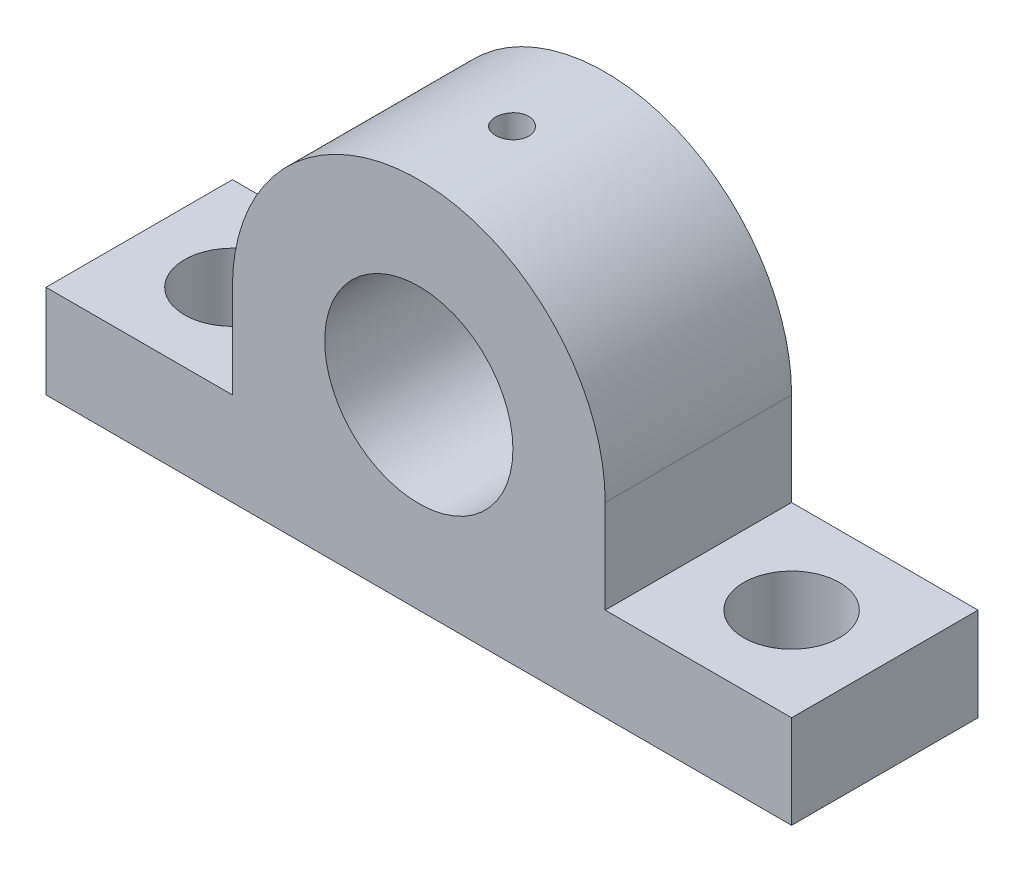
ISO-10303-21;
HEADER;
FILE_DESCRIPTION(('STEP AP214'),'2;1');
FILE_NAME('part.step','',(''),(''),'','','');
FILE_SCHEMA(('AUTOMOTIVE_DESIGN { 1 0 10303 214 1 1 1 1 }'));
ENDSEC;
DATA;
#1=APPLICATION_CONTEXT('core data for automotive mechanical design processes');
#2=APPLICATION_PROTOCOL_DEFINITION('international standard','automotive_design',2000,#1);
#3=PRODUCT_CONTEXT('',#1,'mechanical');
#4=PRODUCT('Part','Part','',(#3));
#5=PRODUCT_RELATED_PRODUCT_CATEGORY('part','',(#4));
#6=PRODUCT_DEFINITION_FORMATION('','',#4);
#7=PRODUCT_DEFINITION_CONTEXT('part definition',#1,'design');
#8=PRODUCT_DEFINITION('design','',#6,#7);
#9=PRODUCT_DEFINITION_SHAPE('','',#8);
#10=(LENGTH_UNIT() NAMED_UNIT(*) SI_UNIT(.MILLI.,.METRE.));
#11=(NAMED_UNIT(*) PLANE_ANGLE_UNIT() SI_UNIT($,.RADIAN.));
#12=(NAMED_UNIT(*) SI_UNIT($,.STERADIAN.) SOLID_ANGLE_UNIT());
#13=UNCERTAINTY_MEASURE_WITH_UNIT(LENGTH_MEASURE(1.E-05),#10,'distance_accuracy_value','');
#14=(GEOMETRIC_REPRESENTATION_CONTEXT(3) GLOBAL_UNCERTAINTY_ASSIGNED_CONTEXT((#13)) GLOBAL_UNIT_ASSIGNED_CONTEXT((#10,
#11,#12)) REPRESENTATION_CONTEXT('',''));
#15=CARTESIAN_POINT('',(0.,0.,0.));
#16=DIRECTION('',(0.,0.,1.));
#17=DIRECTION('',(1.,0.,0.));
#18=AXIS2_PLACEMENT_3D('',#15,#16,#17);
#19=CARTESIAN_POINT('',(0.,12.7,12.7));
#20=DIRECTION('',(0.,0.,-1.));
#21=DIRECTION('',(-1.,0.,0.));
#22=AXIS2_PLACEMENT_3D('',#19,#20,#21);
#23=PLANE('',#22);
#24=CARTESIAN_POINT('',(0.,12.7,12.7));
#25=DIRECTION('',(0.,0.,1.));
#26=DIRECTION('',(-1.,0.,0.));
#27=AXIS2_PLACEMENT_3D('',#24,#25,#26);
#28=CIRCLE('',#27,12.7);
#29=CARTESIAN_POINT('',(12.7,12.7,12.7));
#30=VERTEX_POINT('',#29);
#31=CARTESIAN_POINT('',(-12.7,12.7,12.7));
#32=VERTEX_POINT('',#31);
#33=EDGE_CURVE('E154',#30,#32,#28,.T.);
#34=ORIENTED_EDGE('',*,*,#33,.T.);
#35=DIRECTION('',(0.,-1.,0.));
#36=VECTOR('',#35,1.);
#37=CARTESIAN_POINT('',(-12.7,6.34999999999998,12.7));
#38=LINE('',#37,#36);
#39=CARTESIAN_POINT('',(-12.7,6.34999999999998,12.7));
#40=VERTEX_POINT('',#39);
#41=EDGE_CURVE('E102',#32,#40,#38,.T.);
#42=ORIENTED_EDGE('',*,*,#41,.T.);
#43=DIRECTION('',(-1.,0.,0.));
#44=VECTOR('',#43,1.);
#45=CARTESIAN_POINT('',(-25.4,6.35,12.7));
#46=LINE('',#45,#44);
#47=CARTESIAN_POINT('',(-25.4,6.35,12.7));
#48=VERTEX_POINT('',#47);
#49=EDGE_CURVE('E186',#40,#48,#46,.T.);
#50=ORIENTED_EDGE('',*,*,#49,.T.);
#51=DIRECTION('',(0.,-1.,0.));
#52=VECTOR('',#51,1.);
#53=CARTESIAN_POINT('',(-25.4,0.,12.7));
#54=LINE('',#53,#52);
#55=CARTESIAN_POINT('',(-25.4,0.,12.7));
#56=VERTEX_POINT('',#55);
#57=EDGE_CURVE('E185',#48,#56,#54,.T.);
#58=ORIENTED_EDGE('',*,*,#57,.T.);
#59=DIRECTION('',(1.,0.,0.));
#60=VECTOR('',#59,1.);
#61=CARTESIAN_POINT('',(25.4,0.,12.7));
#62=LINE('',#61,#60);
#63=CARTESIAN_POINT('',(25.4,0.,12.7));
#64=VERTEX_POINT('',#63);
#65=EDGE_CURVE('E121',#56,#64,#62,.T.);
#66=ORIENTED_EDGE('',*,*,#65,.T.);
#67=DIRECTION('',(0.,1.,0.));
#68=VECTOR('',#67,1.);
#69=CARTESIAN_POINT('',(25.4,6.35,12.7));
#70=LINE('',#69,#68);
#71=CARTESIAN_POINT('',(25.4,6.35,12.7));
#72=VERTEX_POINT('',#71);
#73=EDGE_CURVE('E115',#64,#72,#70,.T.);
#74=ORIENTED_EDGE('',*,*,#73,.T.);
#75=DIRECTION('',(-1.,0.,0.));
#76=VECTOR('',#75,1.);
#77=CARTESIAN_POINT('',(12.7,6.34999999999998,12.7));
#78=LINE('',#77,#76);
#79=CARTESIAN_POINT('',(12.7,6.34999999999998,12.7));
#80=VERTEX_POINT('',#79);
#81=EDGE_CURVE('E119',#72,#80,#78,.T.);
#82=ORIENTED_EDGE('',*,*,#81,.T.);
#83=DIRECTION('',(0.,1.,0.));
#84=VECTOR('',#83,1.);
#85=CARTESIAN_POINT('',(12.7,12.7,12.7));
#86=LINE('',#85,#84);
#87=EDGE_CURVE('E58',#80,#30,#86,.T.);
#88=ORIENTED_EDGE('',*,*,#87,.T.);
#89=EDGE_LOOP('',(#34,#42,#50,#58,#66,#74,#82,#88));
#90=FACE_BOUND('',#89,.T.);
#91=CARTESIAN_POINT('',(0.,12.7,12.7));
#92=DIRECTION('',(0.,0.,1.));
#93=DIRECTION('',(1.,0.,0.));
#94=AXIS2_PLACEMENT_3D('',#91,#92,#93);
#95=CIRCLE('',#94,6.4135);
#96=CARTESIAN_POINT('',(6.4135,12.7,12.7));
#97=VERTEX_POINT('',#96);
#98=EDGE_CURVE('E143',#97,#97,#95,.T.);
#99=ORIENTED_EDGE('',*,*,#98,.F.);
#100=EDGE_LOOP('',(#99));
#101=FACE_BOUND('',#100,.T.);
#102=ADVANCED_FACE('F37',(#90,#101),#23,.F.);
#103=CARTESIAN_POINT('',(0.,12.7,0.));
#104=DIRECTION('',(0.,0.,-1.));
#105=DIRECTION('',(-1.,0.,0.));
#106=AXIS2_PLACEMENT_3D('',#103,#104,#105);
#107=PLANE('',#106);
#108=CARTESIAN_POINT('',(0.,12.7,0.));
#109=DIRECTION('',(0.,0.,1.));
#110=DIRECTION('',(-1.,0.,0.));
#111=AXIS2_PLACEMENT_3D('',#108,#109,#110);
#112=CIRCLE('',#111,12.7);
#113=CARTESIAN_POINT('',(12.7,12.7,0.));
#114=VERTEX_POINT('',#113);
#115=CARTESIAN_POINT('',(-12.7,12.7,0.));
#116=VERTEX_POINT('',#115);
#117=EDGE_CURVE('E139',#114,#116,#112,.T.);
#118=ORIENTED_EDGE('',*,*,#117,.F.);
#119=DIRECTION('',(0.,1.,0.));
#120=VECTOR('',#119,1.);
#121=CARTESIAN_POINT('',(12.7,12.7,0.));
#122=LINE('',#121,#120);
#123=CARTESIAN_POINT('',(12.7,6.34999999999998,0.));
#124=VERTEX_POINT('',#123);
#125=EDGE_CURVE('E93',#124,#114,#122,.T.);
#126=ORIENTED_EDGE('',*,*,#125,.F.);
#127=DIRECTION('',(-1.,0.,0.));
#128=VECTOR('',#127,1.);
#129=CARTESIAN_POINT('',(12.7,6.34999999999998,0.));
#130=LINE('',#129,#128);
#131=CARTESIAN_POINT('',(25.4,6.35,0.));
#132=VERTEX_POINT('',#131);
#133=EDGE_CURVE('E87',#132,#124,#130,.T.);
#134=ORIENTED_EDGE('',*,*,#133,.F.);
#135=DIRECTION('',(0.,1.,0.));
#136=VECTOR('',#135,1.);
#137=CARTESIAN_POINT('',(25.4,6.35,0.));
#138=LINE('',#137,#136);
#139=CARTESIAN_POINT('',(25.4,0.,0.));
#140=VERTEX_POINT('',#139);
#141=EDGE_CURVE('E129',#140,#132,#138,.T.);
#142=ORIENTED_EDGE('',*,*,#141,.F.);
#143=DIRECTION('',(1.,0.,0.));
#144=VECTOR('',#143,1.);
#145=CARTESIAN_POINT('',(25.4,0.,0.));
#146=LINE('',#145,#144);
#147=CARTESIAN_POINT('',(-25.4,0.,0.));
#148=VERTEX_POINT('',#147);
#149=EDGE_CURVE('E149',#148,#140,#146,.T.);
#150=ORIENTED_EDGE('',*,*,#149,.F.);
#151=DIRECTION('',(0.,-1.,0.));
#152=VECTOR('',#151,1.);
#153=CARTESIAN_POINT('',(-25.4,0.,0.));
#154=LINE('',#153,#152);
#155=CARTESIAN_POINT('',(-25.4,6.35,0.));
#156=VERTEX_POINT('',#155);
#157=EDGE_CURVE('E147',#156,#148,#154,.T.);
#158=ORIENTED_EDGE('',*,*,#157,.F.);
#159=DIRECTION('',(-1.,0.,0.));
#160=VECTOR('',#159,1.);
#161=CARTESIAN_POINT('',(-25.4,6.35,0.));
#162=LINE('',#161,#160);
#163=CARTESIAN_POINT('',(-12.7,6.34999999999998,0.));
#164=VERTEX_POINT('',#163);
#165=EDGE_CURVE('E145',#164,#156,#162,.T.);
#166=ORIENTED_EDGE('',*,*,#165,.F.);
#167=DIRECTION('',(0.,-1.,0.));
#168=VECTOR('',#167,1.);
#169=CARTESIAN_POINT('',(-12.7,6.34999999999998,0.));
#170=LINE('',#169,#168);
#171=EDGE_CURVE('E142',#116,#164,#170,.T.);
#172=ORIENTED_EDGE('',*,*,#171,.F.);
#173=EDGE_LOOP('',(#118,#126,#134,#142,#150,#158,#166,#172));
#174=FACE_BOUND('',#173,.T.);
#175=CARTESIAN_POINT('',(0.,12.7,0.));
#176=DIRECTION('',(0.,0.,1.));
#177=DIRECTION('',(1.,0.,0.));
#178=AXIS2_PLACEMENT_3D('',#175,#176,#177);
#179=CIRCLE('',#178,6.4135);
#180=CARTESIAN_POINT('',(6.4135,12.7,0.));
#181=VERTEX_POINT('',#180);
#182=EDGE_CURVE('E192',#181,#181,#179,.T.);
#183=ORIENTED_EDGE('',*,*,#182,.T.);
#184=EDGE_LOOP('',(#183));
#185=FACE_BOUND('',#184,.T.);
#186=ADVANCED_FACE('F172',(#174,#185),#107,.T.);
#187=CARTESIAN_POINT('',(0.,12.7,12.7));
#188=DIRECTION('',(0.,0.,-1.));
#189=DIRECTION('',(-1.,0.,0.));
#190=AXIS2_PLACEMENT_3D('',#187,#188,#189);
#191=CYLINDRICAL_SURFACE('',#190,12.7);
#192=CARTESIAN_POINT('',(0.,25.4,7.48029999999999));
#193=CARTESIAN_POINT('',(-0.0633549662870578,25.3999993442662,7.48029724003476));
#194=CARTESIAN_POINT('',(-0.126752665207346,25.3995208743728,7.47495536954308));
#195=CARTESIAN_POINT('',(-0.251792843437397,25.3976581682521,7.45372488396833));
#196=CARTESIAN_POINT('',(-0.313433270551565,25.3962729149133,7.4378244253475));
#197=CARTESIAN_POINT('',(-0.433129919396753,25.3927531279238,7.39594120531932));
#198=CARTESIAN_POINT('',(-0.491188190521168,25.3906190274599,7.36996427195248));
#199=CARTESIAN_POINT('',(-0.602106922425868,25.38584065064,7.30867620975679));
#200=CARTESIAN_POINT('',(-0.654968466792388,25.3831964809822,7.27336703251195));
#201=CARTESIAN_POINT('',(-0.754159197131338,25.3776859812866,7.1943070358195));
#202=CARTESIAN_POINT('',(-0.800471309893536,25.3748190997261,7.15053483238661));
#203=CARTESIAN_POINT('',(-0.885101966605941,25.3691908973995,7.0558366654742));
#204=CARTESIAN_POINT('',(-0.923420153597663,25.3664295813516,7.00491038270831));
#205=CARTESIAN_POINT('',(-0.991034006795324,25.3613193372878,6.89724503088178));
#206=CARTESIAN_POINT('',(-1.02031450821889,25.3589711052143,6.8404964024736));
#207=CARTESIAN_POINT('',(-1.06892497046168,25.3549594154603,6.7228637545467));
#208=CARTESIAN_POINT('',(-1.0882551293388,25.35329594415,6.66197981736708));
#209=CARTESIAN_POINT('',(-1.11636627626064,25.3508468875705,6.53797702762159));
#210=CARTESIAN_POINT('',(-1.12517526603385,25.35005897243,6.4748645697588));
#211=CARTESIAN_POINT('',(-1.13208054267278,25.3494429242787,6.34805236994686));
#212=CARTESIAN_POINT('',(-1.13017705628481,25.3496147709531,6.28435264045674));
#213=CARTESIAN_POINT('',(-1.11573453505945,25.3508967086965,6.15836635356778));
#214=CARTESIAN_POINT('',(-1.10322597749987,25.3520041110958,6.09607627119771));
#215=CARTESIAN_POINT('',(-1.06797575874834,25.3550281729631,5.97448319903358));
#216=CARTESIAN_POINT('',(-1.04523398531445,25.3569448413074,5.91518024201141));
#217=CARTESIAN_POINT('',(-0.990128920983864,25.361374570342,5.8011479590833));
#218=CARTESIAN_POINT('',(-0.957752004966509,25.3638884745654,5.74642525149116));
#219=CARTESIAN_POINT('',(-0.884305528900142,25.3692286657572,5.643179234958));
#220=CARTESIAN_POINT('',(-0.843235767712833,25.3720549599532,5.59465606950595));
#221=CARTESIAN_POINT('',(-0.753398711268003,25.3777134478915,5.50500935657507));
#222=CARTESIAN_POINT('',(-0.704605076649212,25.3805456278451,5.46391219888644));
#223=CARTESIAN_POINT('',(-0.600797098391808,25.3858874119665,5.39048829921771));
#224=CARTESIAN_POINT('',(-0.54578274978635,25.3883970158769,5.35816156424032));
#225=CARTESIAN_POINT('',(-0.431077483891174,25.392811467624,5.30319760327075));
#226=CARTESIAN_POINT('',(-0.371385977360789,25.3947162391092,5.28056160047193));
#227=CARTESIAN_POINT('',(-0.249028930160306,25.3977055702252,5.24564040925024));
#228=CARTESIAN_POINT('',(-0.18636345993934,25.3987901492749,5.23335497576568));
#229=CARTESIAN_POINT('',(-0.0600660041406298,25.4000144007699,5.2195168734993));
#230=CARTESIAN_POINT('',(0.00356195903674101,25.4001572813243,5.2179277648704));
#231=CARTESIAN_POINT('',(0.130179123062569,25.3994906162937,5.22543188209142));
#232=CARTESIAN_POINT('',(0.193168330713415,25.3986810808622,5.23452499406092));
#233=CARTESIAN_POINT('',(0.316615641736331,25.3962026618106,5.26310522055372));
#234=CARTESIAN_POINT('',(0.377077698751922,25.3945351793369,5.28257538975868));
#235=CARTESIAN_POINT('',(0.493877017716602,25.3905281036814,5.33133970260505));
#236=CARTESIAN_POINT('',(0.550214205605928,25.3881884984357,5.36063402258104));
#237=CARTESIAN_POINT('',(0.657330068574673,25.3830912656799,5.42830626758675));
#238=CARTESIAN_POINT('',(0.708093479326379,25.3803325372428,5.46670826972497));
#239=CARTESIAN_POINT('',(0.802466579915457,25.3747105175414,5.55147108959152));
#240=CARTESIAN_POINT('',(0.846076127884285,25.3718472242049,5.59783206511727));
#241=CARTESIAN_POINT('',(0.925029072785658,25.3663292375558,5.69735522148087));
#242=CARTESIAN_POINT('',(0.960348646577445,25.3636751596435,5.75053634038371));
#243=CARTESIAN_POINT('',(1.0215555683374,25.3588850522987,5.8620961766991));
#244=CARTESIAN_POINT('',(1.0474430217618,25.3567490170742,5.92047483599125));
#245=CARTESIAN_POINT('',(1.08901049476345,25.3532404409206,6.0406890927983));
#246=CARTESIAN_POINT('',(1.10470496682232,25.3518668193799,6.10251966012658));
#247=CARTESIAN_POINT('',(1.12548797292161,25.3500350747212,6.22795116440113));
#248=CARTESIAN_POINT('',(1.1305767425878,25.349576931264,6.29155206198435));
#249=CARTESIAN_POINT('',(1.13000099869347,25.3496283581755,6.41848207312603));
#250=CARTESIAN_POINT('',(1.12437391313382,25.3501345603107,6.48181136117063));
#251=CARTESIAN_POINT('',(1.10260437390431,25.3520504780416,6.60662147608813));
#252=CARTESIAN_POINT('',(1.08646190541541,25.3534601949106,6.6681023003559));
#253=CARTESIAN_POINT('',(1.04412958765887,25.3570234016182,6.78747181886868));
#254=CARTESIAN_POINT('',(1.01794055344362,25.3591768311197,6.84536080406799));
#255=CARTESIAN_POINT('',(0.956262575165945,25.3639849385614,6.95592679097092));
#256=CARTESIAN_POINT('',(0.920773746892055,25.3666396102607,7.00860385755511));
#257=CARTESIAN_POINT('',(0.841362858948849,25.3721621485101,7.10744239453589));
#258=CARTESIAN_POINT('',(0.797413007717864,25.3750306980047,7.15358149804653));
#259=CARTESIAN_POINT('',(0.702379940550793,25.3806515272886,7.23784791883046));
#260=CARTESIAN_POINT('',(0.651295006881939,25.3834037788712,7.2759733012906));
#261=CARTESIAN_POINT('',(0.543330140990365,25.3884875727795,7.34318879188415));
#262=CARTESIAN_POINT('',(0.486438442445035,25.3908182332511,7.37226005080951));
#263=CARTESIAN_POINT('',(0.36859850424394,25.3947861884187,7.42039954764974));
#264=CARTESIAN_POINT('',(0.30765498932782,25.3964242748526,7.43947921375826));
#265=CARTESIAN_POINT('',(0.205297080416444,25.3984048358795,7.46226710949989));
#266=CARTESIAN_POINT('',(0.164539754289081,25.3990002781437,7.46902037541737));
#267=CARTESIAN_POINT('',(0.0825276628943296,25.3997980731845,7.47803771269836));
#268=CARTESIAN_POINT('',(0.0412728991709895,25.4000004271809,7.48030179799268));
#269=CARTESIAN_POINT('',(0.,25.4,7.48029999999999));
#270=B_SPLINE_CURVE_WITH_KNOTS('',3,(#192,#193,#194,#195,#196,#197,#198,#199,#200,#201,#202,
#203,#204,#205,#206,#207,#208,#209,#210,#211,#212,#213,#214,#215,#216,#217,#218,#219,#220,#221,
#222,#223,#224,#225,#226,#227,#228,#229,#230,#231,#232,#233,#234,#235,#236,#237,#238,#239,#240,
#241,#242,#243,#244,#245,#246,#247,#248,#249,#250,#251,#252,#253,#254,#255,#256,#257,#258,#259,
#260,#261,#262,#263,#264,#265,#266,#267,#268,#269),.UNSPECIFIED.,.T.,.F.,(4,2,2,2,2,2,2,2,2,2,2,
2,2,2,2,2,2,2,2,2,2,2,2,2,2,2,2,2,2,2,2,2,2,2,2,2,2,2,4),(0.,0.189914200719065,
0.380041788304175,0.570059573297016,0.760037652656215,0.950502185906141,1.14097522228553,
1.33176614687074,1.52255327368611,1.71283148752737,1.90310567384788,2.09283488891786,
2.28256618506335,2.47256706685702,2.66257234544272,2.85324010665161,3.04390802009769,
3.23459999313064,3.42528745118415,3.61532495194649,3.80536042678586,3.99508652784742,
4.18481603450221,4.37505281433223,4.56529336629957,4.75607410165667,4.94685270391611,
5.13736020994906,5.32786348345199,5.51770259330724,5.70754197069812,5.89736595015785,
6.08718756629664,6.27764366067291,6.46814568561703,6.65904169388159,6.84971887938922,
6.97343978780012,7.09716031227964),.UNSPECIFIED.);
#271=CARTESIAN_POINT('',(0.,25.4,7.48029999999999));
#272=VERTEX_POINT('',#271);
#273=EDGE_CURVE('E11',#272,#272,#270,.T.);
#274=ORIENTED_EDGE('',*,*,#273,.T.);
#275=EDGE_LOOP('',(#274));
#276=FACE_BOUND('',#275,.T.);
#277=ORIENTED_EDGE('',*,*,#117,.T.);
#278=DIRECTION('',(0.,0.,-1.));
#279=VECTOR('',#278,1.);
#280=CARTESIAN_POINT('',(-12.7,12.7,12.7));
#281=LINE('',#280,#279);
#282=EDGE_CURVE('E50',#32,#116,#281,.T.);
#283=ORIENTED_EDGE('',*,*,#282,.F.);
#284=ORIENTED_EDGE('',*,*,#33,.F.);
#285=DIRECTION('',(0.,0.,-1.));
#286=VECTOR('',#285,1.);
#287=CARTESIAN_POINT('',(12.7,12.7,12.7));
#288=LINE('',#287,#286);
#289=EDGE_CURVE('E135',#30,#114,#288,.T.);
#290=ORIENTED_EDGE('',*,*,#289,.T.);
#291=EDGE_LOOP('',(#277,#283,#284,#290));
#292=FACE_BOUND('',#291,.T.);
#293=ADVANCED_FACE('F39',(#276,#292),#191,.T.);
#294=CARTESIAN_POINT('',(-12.7,6.34999999999998,12.7));
#295=DIRECTION('',(1.,0.,0.));
#296=DIRECTION('',(0.,1.,0.));
#297=AXIS2_PLACEMENT_3D('',#294,#295,#296);
#298=PLANE('',#297);
#299=ORIENTED_EDGE('',*,*,#171,.T.);
#300=DIRECTION('',(0.,0.,-1.));
#301=VECTOR('',#300,1.);
#302=CARTESIAN_POINT('',(-12.7,6.34999999999998,12.7));
#303=LINE('',#302,#301);
#304=EDGE_CURVE('E164',#40,#164,#303,.T.);
#305=ORIENTED_EDGE('',*,*,#304,.F.);
#306=ORIENTED_EDGE('',*,*,#41,.F.);
#307=ORIENTED_EDGE('',*,*,#282,.T.);
#308=EDGE_LOOP('',(#299,#305,#306,#307));
#309=FACE_BOUND('',#308,.T.);
#310=ADVANCED_FACE('F167',(#309),#298,.F.);
#311=CARTESIAN_POINT('',(-25.4,6.35,12.7));
#312=DIRECTION('',(0.,-1.,0.));
#313=DIRECTION('',(1.,0.,0.));
#314=AXIS2_PLACEMENT_3D('',#311,#312,#313);
#315=PLANE('',#314);
#316=CARTESIAN_POINT('',(-19.05,6.34999999999996,6.35));
#317=DIRECTION('',(0.,1.,0.));
#318=DIRECTION('',(0.,0.,-1.));
#319=AXIS2_PLACEMENT_3D('',#316,#317,#318);
#320=CIRCLE('',#319,3.2639);
#321=CARTESIAN_POINT('',(-19.05,6.34999999999996,3.0861));
#322=VERTEX_POINT('',#321);
#323=EDGE_CURVE('E198',#322,#322,#320,.T.);
#324=ORIENTED_EDGE('',*,*,#323,.F.);
#325=EDGE_LOOP('',(#324));
#326=FACE_BOUND('',#325,.T.);
#327=ORIENTED_EDGE('',*,*,#165,.T.);
#328=DIRECTION('',(0.,0.,-1.));
#329=VECTOR('',#328,1.);
#330=CARTESIAN_POINT('',(-25.4,6.35,12.7));
#331=LINE('',#330,#329);
#332=EDGE_CURVE('E161',#48,#156,#331,.T.);
#333=ORIENTED_EDGE('',*,*,#332,.F.);
#334=ORIENTED_EDGE('',*,*,#49,.F.);
#335=ORIENTED_EDGE('',*,*,#304,.T.);
#336=EDGE_LOOP('',(#327,#333,#334,#335));
#337=FACE_BOUND('',#336,.T.);
#338=ADVANCED_FACE('F179',(#326,#337),#315,.F.);
#339=CARTESIAN_POINT('',(-25.4,0.,12.7));
#340=DIRECTION('',(1.,0.,0.));
#341=DIRECTION('',(0.,0.,-1.));
#342=AXIS2_PLACEMENT_3D('',#339,#340,#341);
#343=PLANE('',#342);
#344=ORIENTED_EDGE('',*,*,#157,.T.);
#345=DIRECTION('',(0.,0.,-1.));
#346=VECTOR('',#345,1.);
#347=CARTESIAN_POINT('',(-25.4,0.,12.7));
#348=LINE('',#347,#346);
#349=EDGE_CURVE('E158',#56,#148,#348,.T.);
#350=ORIENTED_EDGE('',*,*,#349,.F.);
#351=ORIENTED_EDGE('',*,*,#57,.F.);
#352=ORIENTED_EDGE('',*,*,#332,.T.);
#353=EDGE_LOOP('',(#344,#350,#351,#352));
#354=FACE_BOUND('',#353,.T.);
#355=ADVANCED_FACE('F183',(#354),#343,.F.);
#356=CARTESIAN_POINT('',(25.4,0.,12.7));
#357=DIRECTION('',(0.,1.,0.));
#358=DIRECTION('',(-1.,0.,0.));
#359=AXIS2_PLACEMENT_3D('',#356,#357,#358);
#360=PLANE('',#359);
#361=CARTESIAN_POINT('',(19.05,0.,6.35));
#362=DIRECTION('',(0.,1.,0.));
#363=DIRECTION('',(0.,0.,1.));
#364=AXIS2_PLACEMENT_3D('',#361,#362,#363);
#365=CIRCLE('',#364,3.2639);
#366=CARTESIAN_POINT('',(19.05,0.,9.6139));
#367=VERTEX_POINT('',#366);
#368=EDGE_CURVE('E195',#367,#367,#365,.T.);
#369=ORIENTED_EDGE('',*,*,#368,.T.);
#370=EDGE_LOOP('',(#369));
#371=FACE_BOUND('',#370,.T.);
#372=CARTESIAN_POINT('',(-19.05,0.,6.35));
#373=DIRECTION('',(0.,1.,0.));
#374=DIRECTION('',(0.,0.,-1.));
#375=AXIS2_PLACEMENT_3D('',#372,#373,#374);
#376=CIRCLE('',#375,3.2639);
#377=CARTESIAN_POINT('',(-19.05,0.,3.0861));
#378=VERTEX_POINT('',#377);
#379=EDGE_CURVE('E201',#378,#378,#376,.T.);
#380=ORIENTED_EDGE('',*,*,#379,.T.);
#381=EDGE_LOOP('',(#380));
#382=FACE_BOUND('',#381,.T.);
#383=ORIENTED_EDGE('',*,*,#149,.T.);
#384=DIRECTION('',(0.,0.,-1.));
#385=VECTOR('',#384,1.);
#386=CARTESIAN_POINT('',(25.4,0.,12.7));
#387=LINE('',#386,#385);
#388=EDGE_CURVE('E130',#64,#140,#387,.T.);
#389=ORIENTED_EDGE('',*,*,#388,.F.);
#390=ORIENTED_EDGE('',*,*,#65,.F.);
#391=ORIENTED_EDGE('',*,*,#349,.T.);
#392=EDGE_LOOP('',(#383,#389,#390,#391));
#393=FACE_BOUND('',#392,.T.);
#394=ADVANCED_FACE('F248',(#371,#382,#393),#360,.F.);
#395=CARTESIAN_POINT('',(25.4,6.35,12.7));
#396=DIRECTION('',(-1.,0.,0.));
#397=DIRECTION('',(0.,0.,1.));
#398=AXIS2_PLACEMENT_3D('',#395,#396,#397);
#399=PLANE('',#398);
#400=ORIENTED_EDGE('',*,*,#141,.T.);
#401=DIRECTION('',(0.,0.,-1.));
#402=VECTOR('',#401,1.);
#403=CARTESIAN_POINT('',(25.4,6.35,12.7));
#404=LINE('',#403,#402);
#405=EDGE_CURVE('E126',#72,#132,#404,.T.);
#406=ORIENTED_EDGE('',*,*,#405,.F.);
#407=ORIENTED_EDGE('',*,*,#73,.F.);
#408=ORIENTED_EDGE('',*,*,#388,.T.);
#409=EDGE_LOOP('',(#400,#406,#407,#408));
#410=FACE_BOUND('',#409,.T.);
#411=ADVANCED_FACE('F127',(#410),#399,.F.);
#412=CARTESIAN_POINT('',(12.7,6.34999999999998,12.7));
#413=DIRECTION('',(0.,-1.,0.));
#414=DIRECTION('',(1.,0.,0.));
#415=AXIS2_PLACEMENT_3D('',#412,#413,#414);
#416=PLANE('',#415);
#417=CARTESIAN_POINT('',(19.05,6.34999999999996,6.35));
#418=DIRECTION('',(0.,1.,0.));
#419=DIRECTION('',(0.,0.,1.));
#420=AXIS2_PLACEMENT_3D('',#417,#418,#419);
#421=CIRCLE('',#420,3.2639);
#422=CARTESIAN_POINT('',(19.05,6.34999999999996,9.6139));
#423=VERTEX_POINT('',#422);
#424=EDGE_CURVE('E205',#423,#423,#421,.T.);
#425=ORIENTED_EDGE('',*,*,#424,.F.);
#426=EDGE_LOOP('',(#425));
#427=FACE_BOUND('',#426,.T.);
#428=ORIENTED_EDGE('',*,*,#133,.T.);
#429=DIRECTION('',(0.,0.,-1.));
#430=VECTOR('',#429,1.);
#431=CARTESIAN_POINT('',(12.7,6.34999999999998,12.7));
#432=LINE('',#431,#430);
#433=EDGE_CURVE('E131',#80,#124,#432,.T.);
#434=ORIENTED_EDGE('',*,*,#433,.F.);
#435=ORIENTED_EDGE('',*,*,#81,.F.);
#436=ORIENTED_EDGE('',*,*,#405,.T.);
#437=EDGE_LOOP('',(#428,#434,#435,#436));
#438=FACE_BOUND('',#437,.T.);
#439=ADVANCED_FACE('F133',(#427,#438),#416,.F.);
#440=CARTESIAN_POINT('',(12.7,12.7,12.7));
#441=DIRECTION('',(-1.,0.,0.));
#442=DIRECTION('',(0.,-1.,0.));
#443=AXIS2_PLACEMENT_3D('',#440,#441,#442);
#444=PLANE('',#443);
#445=ORIENTED_EDGE('',*,*,#125,.T.);
#446=ORIENTED_EDGE('',*,*,#289,.F.);
#447=ORIENTED_EDGE('',*,*,#87,.F.);
#448=ORIENTED_EDGE('',*,*,#433,.T.);
#449=EDGE_LOOP('',(#445,#446,#447,#448));
#450=FACE_BOUND('',#449,.T.);
#451=ADVANCED_FACE('F240',(#450),#444,.F.);
#452=CARTESIAN_POINT('',(0.,12.7,12.7));
#453=DIRECTION('',(0.,0.,-1.));
#454=DIRECTION('',(-1.,0.,0.));
#455=AXIS2_PLACEMENT_3D('',#452,#453,#454);
#456=CYLINDRICAL_SURFACE('',#455,6.4135);
#457=CARTESIAN_POINT('',(0.,19.1135,7.48029999999999));
#458=CARTESIAN_POINT('',(-0.0629667680306317,19.11349888896,7.48029752544253));
#459=CARTESIAN_POINT('',(-0.125966542634988,19.1125630812689,7.47502059182648));
#460=CARTESIAN_POINT('',(-0.250195422480828,19.1089201088044,7.45406319880241));
#461=CARTESIAN_POINT('',(-0.311422908862134,19.1062113747861,7.43837352274086));
#462=CARTESIAN_POINT('',(-0.430292222542112,19.0993260080954,7.39708217297692));
#463=CARTESIAN_POINT('',(-0.487937070675244,19.095150632395,7.3714889850874));
#464=CARTESIAN_POINT('',(-0.598108027804004,19.085789671171,7.31114017940616));
#465=CARTESIAN_POINT('',(-0.650634644804086,19.0806041860582,7.27638547220239));
#466=CARTESIAN_POINT('',(-0.749643351269017,19.0697350576163,7.19830724658693));
#467=CARTESIAN_POINT('',(-0.796063097910746,19.0640471396059,7.15490525981296));
#468=CARTESIAN_POINT('',(-0.881001490539704,19.0528464814586,7.0609333616142));
#469=CARTESIAN_POINT('',(-0.919519608087005,19.0473337530589,7.01036297116786));
#470=CARTESIAN_POINT('',(-0.987815443920341,19.0370661979447,6.9030559771946));
#471=CARTESIAN_POINT('',(-1.01753072014088,19.0323168901506,6.84627905791507));
#472=CARTESIAN_POINT('',(-1.06697787466043,19.024173655157,6.72844162797331));
#473=CARTESIAN_POINT('',(-1.08671050967329,19.0207796252275,6.66738144239505));
#474=CARTESIAN_POINT('',(-1.11543417274651,19.0157740099905,6.54337445763642));
#475=CARTESIAN_POINT('',(-1.12453333118402,19.0141444942984,6.48045344237502));
#476=CARTESIAN_POINT('',(-1.13206717577236,19.0127982538011,6.35395828368538));
#477=CARTESIAN_POINT('',(-1.13050270595182,19.0130813776099,6.29038419234595));
#478=CARTESIAN_POINT('',(-1.11684160215346,19.015512075796,6.16516449632194));
#479=CARTESIAN_POINT('',(-1.10486709513716,19.0176380298876,6.10350508677443));
#480=CARTESIAN_POINT('',(-1.07091778774947,19.0234809534156,5.9830843627477));
#481=CARTESIAN_POINT('',(-1.04894260765735,19.027197983264,5.92432315840584));
#482=CARTESIAN_POINT('',(-0.995493890949442,19.0358272628557,5.81100494004839));
#483=CARTESIAN_POINT('',(-0.963970266338077,19.0407457882577,5.75647204858147));
#484=CARTESIAN_POINT('',(-0.89235499960665,19.0512196036239,5.65342374355426));
#485=CARTESIAN_POINT('',(-0.852262586386107,19.0567749508745,5.60490887217358));
#486=CARTESIAN_POINT('',(-0.763985503982629,19.0679911121801,5.51456741173247));
#487=CARTESIAN_POINT('',(-0.715696193439694,19.0736523195387,5.47284305424609));
#488=CARTESIAN_POINT('',(-0.61274829685407,19.0843712044043,5.39807313241757));
#489=CARTESIAN_POINT('',(-0.55808966026974,19.0894288771214,5.36502763695041));
#490=CARTESIAN_POINT('',(-0.443853868989134,19.098379307215,5.30854162717919));
#491=CARTESIAN_POINT('',(-0.384271798068482,19.1022708818222,5.28511085622206));
#492=CARTESIAN_POINT('',(-0.26193397177766,19.1084413194711,5.24861804735811));
#493=CARTESIAN_POINT('',(-0.199178514293311,19.1107203335839,5.23555503814423));
#494=CARTESIAN_POINT('',(-0.0731557320121796,19.1133883588659,5.22030880034066));
#495=CARTESIAN_POINT('',(-0.00990586938111213,19.1138017271379,5.21798535074292));
#496=CARTESIAN_POINT('',(0.116078977595159,19.1127588512525,5.22390933038508));
#497=CARTESIAN_POINT('',(0.178813984063218,19.1113026878548,5.23215630300571));
#498=CARTESIAN_POINT('',(0.301549996256722,19.106699480359,5.25887040993528));
#499=CARTESIAN_POINT('',(0.361566733283749,19.1035640388684,5.27726744060296));
#500=CARTESIAN_POINT('',(0.477664082801888,19.0959523831861,5.32368420421046));
#501=CARTESIAN_POINT('',(0.533744452825927,19.0914760864915,5.35170452928773));
#502=CARTESIAN_POINT('',(0.640981502403692,19.0816186158832,5.41688881637179));
#503=CARTESIAN_POINT('',(0.692084666677751,19.0762290207483,5.45413951960661));
#504=CARTESIAN_POINT('',(0.787364801076706,19.0651664395011,5.536608704773));
#505=CARTESIAN_POINT('',(0.831541204052914,19.0594934302335,5.58182783849984));
#506=CARTESIAN_POINT('',(0.912239422069119,19.0484237260531,5.67958187429152));
#507=CARTESIAN_POINT('',(0.948666062246901,19.0430310203071,5.73219587009744));
#508=CARTESIAN_POINT('',(1.01216406009761,19.0332095199702,5.84287853621246));
#509=CARTESIAN_POINT('',(1.03923573857368,19.0287806923276,5.90094701938777));
#510=CARTESIAN_POINT('',(1.0831162775479,19.0214189463641,6.02063511999372));
#511=CARTESIAN_POINT('',(1.09997083711035,19.0184793767491,6.08223755517063));
#512=CARTESIAN_POINT('',(1.12308130866116,19.0144129352966,6.20745583099982));
#513=CARTESIAN_POINT('',(1.1293382627151,19.013285885234,6.27107147306617));
#514=CARTESIAN_POINT('',(1.13104424343184,19.0129803855986,6.39755870484877));
#515=CARTESIAN_POINT('',(1.12664321089311,19.0137749024513,6.46042825664965));
#516=CARTESIAN_POINT('',(1.10748417252291,19.0171634571191,6.58451694866961));
#517=CARTESIAN_POINT('',(1.09272621220992,19.0197574870254,6.64573609614095));
#518=CARTESIAN_POINT('',(1.05333231871573,19.0264420129145,6.76471808857562));
#519=CARTESIAN_POINT('',(1.02871078327933,19.0305303269493,6.822485830891));
#520=CARTESIAN_POINT('',(0.970304467187064,19.0397446121741,6.93309476218693));
#521=CARTESIAN_POINT('',(0.936519144988896,19.0448706446845,6.98593565976304));
#522=CARTESIAN_POINT('',(0.860215308255605,19.0556677081771,7.08594565782618));
#523=CARTESIAN_POINT('',(0.817586997960929,19.061345061097,7.13303031893598));
#524=CARTESIAN_POINT('',(0.725037763745586,19.0725560631666,7.2194288196347));
#525=CARTESIAN_POINT('',(0.675115163815112,19.0780896789446,7.25874086841135));
#526=CARTESIAN_POINT('',(0.568928599789595,19.0884401645862,7.32876217337423));
#527=CARTESIAN_POINT('',(0.51261810335094,19.0932510917148,7.35940175872036));
#528=CARTESIAN_POINT('',(0.395585047517686,19.1015562950575,7.41073819033486));
#529=CARTESIAN_POINT('',(0.334866837980023,19.1050518488617,7.43144468976898));
#530=CARTESIAN_POINT('',(0.228281144388234,19.1095918259633,7.45796112921641));
#531=CARTESIAN_POINT('',(0.183049253748618,19.1110493622414,7.46632439414136));
#532=CARTESIAN_POINT('',(0.0918840916753053,19.1130038447457,7.47749467511943));
#533=CARTESIAN_POINT('',(0.04595083473626,19.1135008107962,7.48030180584114));
#534=CARTESIAN_POINT('',(0.,19.1135,7.48029999999999));
#535=B_SPLINE_CURVE_WITH_KNOTS('',3,(#457,#458,#459,#460,#461,#462,#463,#464,#465,#466,#467,
#468,#469,#470,#471,#472,#473,#474,#475,#476,#477,#478,#479,#480,#481,#482,#483,#484,#485,#486,
#487,#488,#489,#490,#491,#492,#493,#494,#495,#496,#497,#498,#499,#500,#501,#502,#503,#504,#505,
#506,#507,#508,#509,#510,#511,#512,#513,#514,#515,#516,#517,#518,#519,#520,#521,#522,#523,#524,
#525,#526,#527,#528,#529,#530,#531,#532,#533,#534),.UNSPECIFIED.,.T.,.F.,(4,2,2,2,2,2,2,2,2,2,2,
2,2,2,2,2,2,2,2,2,2,2,2,2,2,2,2,2,2,2,2,2,2,2,2,2,2,2,4),(0.,0.188732304802311,
0.377631885839278,0.566369965615749,0.755089293277355,0.945606257937002,1.13613595971353,
1.32798646928588,1.51982243384001,1.70969018558088,1.89954290941972,2.08719795230057,
2.27486012094726,2.46352427201808,2.6522054080239,2.84350665011602,3.03480941031807,
3.22630555653493,3.41778376025578,3.60675473292191,3.79571754272747,3.98339128689208,
4.17107658100696,4.36059736214448,4.55013365275215,4.74187811057228,4.93361599238169,
5.12448981773438,5.31534487331946,5.50353053967712,5.69171537896806,5.87962652215568,
6.06754877254344,6.25796128997643,6.4484176275191,6.64036318848791,6.83212183322813,
6.96985458031033,7.10758448480766),.UNSPECIFIED.);
#536=CARTESIAN_POINT('',(0.,19.1135,7.48029999999999));
#537=VERTEX_POINT('',#536);
#538=EDGE_CURVE('E202',#537,#537,#535,.T.);
#539=ORIENTED_EDGE('',*,*,#538,.F.);
#540=EDGE_LOOP('',(#539));
#541=FACE_BOUND('',#540,.T.);
#542=ORIENTED_EDGE('',*,*,#98,.T.);
#543=EDGE_LOOP('',(#542));
#544=FACE_BOUND('',#543,.T.);
#545=ORIENTED_EDGE('',*,*,#182,.F.);
#546=EDGE_LOOP('',(#545));
#547=FACE_BOUND('',#546,.T.);
#548=ADVANCED_FACE('F214',(#541,#544,#547),#456,.F.);
#549=CARTESIAN_POINT('',(19.05,0.,6.35));
#550=DIRECTION('',(0.,1.,0.));
#551=DIRECTION('',(0.,0.,1.));
#552=AXIS2_PLACEMENT_3D('',#549,#550,#551);
#553=CYLINDRICAL_SURFACE('',#552,3.2639);
#554=ORIENTED_EDGE('',*,*,#368,.F.);
#555=EDGE_LOOP('',(#554));
#556=FACE_BOUND('',#555,.T.);
#557=ORIENTED_EDGE('',*,*,#424,.T.);
#558=EDGE_LOOP('',(#557));
#559=FACE_BOUND('',#558,.T.);
#560=ADVANCED_FACE('F224',(#556,#559),#553,.F.);
#561=CARTESIAN_POINT('',(-19.05,0.,6.35));
#562=DIRECTION('',(0.,1.,0.));
#563=DIRECTION('',(0.,0.,1.));
#564=AXIS2_PLACEMENT_3D('',#561,#562,#563);
#565=CYLINDRICAL_SURFACE('',#564,3.2639);
#566=ORIENTED_EDGE('',*,*,#379,.F.);
#567=EDGE_LOOP('',(#566));
#568=FACE_BOUND('',#567,.T.);
#569=ORIENTED_EDGE('',*,*,#323,.T.);
#570=EDGE_LOOP('',(#569));
#571=FACE_BOUND('',#570,.T.);
#572=ADVANCED_FACE('F222',(#568,#571),#565,.F.);
#573=CARTESIAN_POINT('',(0.,25.4,6.35));
#574=DIRECTION('',(0.,1.,0.));
#575=DIRECTION('',(0.,0.,1.));
#576=AXIS2_PLACEMENT_3D('',#573,#574,#575);
#577=CYLINDRICAL_SURFACE('',#576,1.13029999999999);
#578=ORIENTED_EDGE('',*,*,#538,.T.);
#579=EDGE_LOOP('',(#578));
#580=FACE_BOUND('',#579,.T.);
#581=ORIENTED_EDGE('',*,*,#273,.F.);
#582=EDGE_LOOP('',(#581));
#583=FACE_BOUND('',#582,.T.);
#584=ADVANCED_FACE('F218',(#580,#583),#577,.F.);
#585=CLOSED_SHELL('',(#102,#186,#293,#310,#338,#355,#394,#411,#439,#451,#548,#560,#572,#584));
#586=MANIFOLD_SOLID_BREP('B2',#585);
#587=ADVANCED_BREP_SHAPE_REPRESENTATION('',(#18,#586),#14);
#588=SHAPE_DEFINITION_REPRESENTATION(#9,#587);
ENDSEC;
END-ISO-10303-21;
